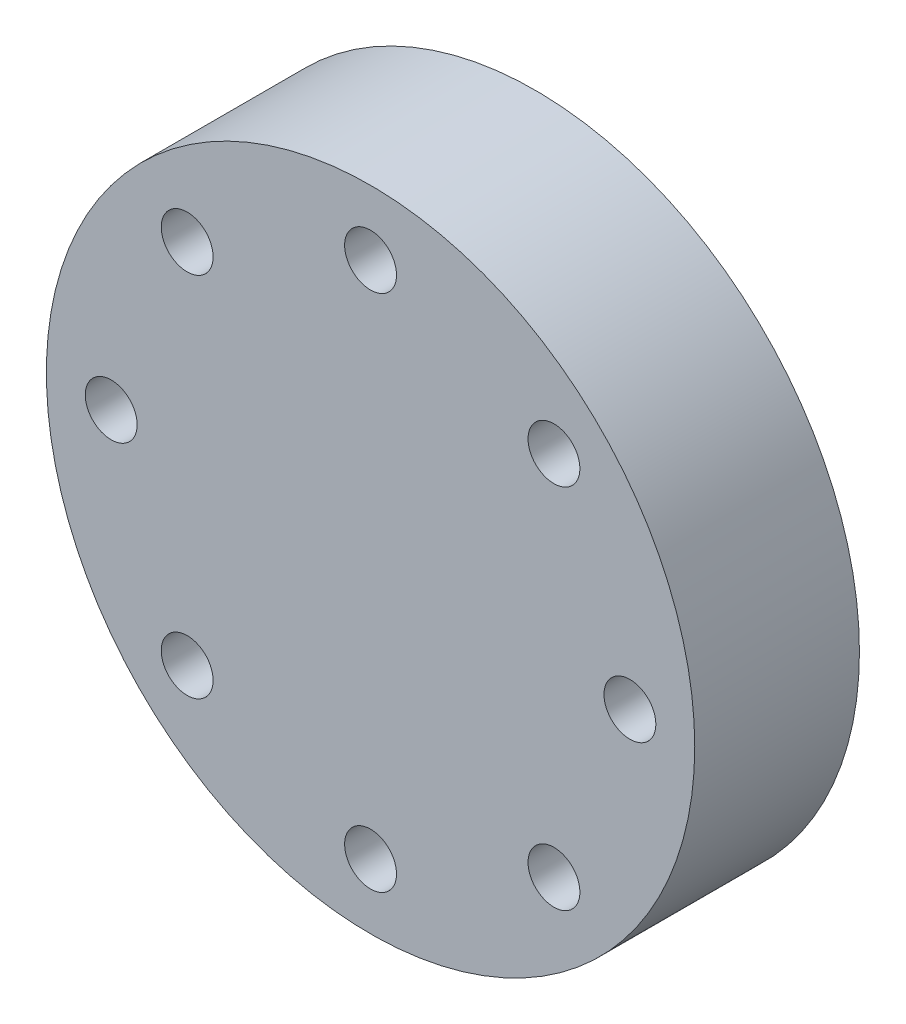
ISO-10303-21;
HEADER;
FILE_DESCRIPTION(('STEP AP214'),'2;1');
FILE_NAME('part.step','',(''),(''),'','','');
FILE_SCHEMA(('AUTOMOTIVE_DESIGN { 1 0 10303 214 1 1 1 1 }'));
ENDSEC;
DATA;
#1=APPLICATION_CONTEXT('core data for automotive mechanical design processes');
#2=APPLICATION_PROTOCOL_DEFINITION('international standard','automotive_design',2000,#1);
#3=PRODUCT_CONTEXT('',#1,'mechanical');
#4=PRODUCT('Part','Part','',(#3));
#5=PRODUCT_RELATED_PRODUCT_CATEGORY('part','',(#4));
#6=PRODUCT_DEFINITION_FORMATION('','',#4);
#7=PRODUCT_DEFINITION_CONTEXT('part definition',#1,'design');
#8=PRODUCT_DEFINITION('design','',#6,#7);
#9=PRODUCT_DEFINITION_SHAPE('','',#8);
#10=(LENGTH_UNIT() NAMED_UNIT(*) SI_UNIT(.MILLI.,.METRE.));
#11=(NAMED_UNIT(*) PLANE_ANGLE_UNIT() SI_UNIT($,.RADIAN.));
#12=(NAMED_UNIT(*) SI_UNIT($,.STERADIAN.) SOLID_ANGLE_UNIT());
#13=UNCERTAINTY_MEASURE_WITH_UNIT(LENGTH_MEASURE(1.E-05),#10,'distance_accuracy_value','');
#14=(GEOMETRIC_REPRESENTATION_CONTEXT(3) GLOBAL_UNCERTAINTY_ASSIGNED_CONTEXT((#13)) GLOBAL_UNIT_ASSIGNED_CONTEXT((#10,
#11,#12)) REPRESENTATION_CONTEXT('',''));
#15=CARTESIAN_POINT('',(0.,0.,0.));
#16=DIRECTION('',(0.,0.,1.));
#17=DIRECTION('',(1.,0.,0.));
#18=AXIS2_PLACEMENT_3D('',#15,#16,#17);
#19=CARTESIAN_POINT('',(0.,0.,25.4));
#20=DIRECTION('',(0.,0.,1.));
#21=DIRECTION('',(1.,0.,0.));
#22=AXIS2_PLACEMENT_3D('',#19,#20,#21);
#23=PLANE('',#22);
#24=CARTESIAN_POINT('',(-39.9999999999983,-1.70897650622168E-12,25.4));
#25=DIRECTION('',(0.,0.,1.));
#26=DIRECTION('',(1.,0.,0.));
#27=AXIS2_PLACEMENT_3D('',#24,#25,#26);
#28=CIRCLE('',#27,4.);
#29=CARTESIAN_POINT('',(-35.9999999999983,-1.70897650622168E-12,25.4));
#30=VERTEX_POINT('',#29);
#31=EDGE_CURVE('E77',#30,#30,#28,.T.);
#32=ORIENTED_EDGE('',*,*,#31,.F.);
#33=EDGE_LOOP('',(#32));
#34=FACE_BOUND('',#33,.T.);
#35=CARTESIAN_POINT('',(3.40815583805019E-12,-40.,25.4));
#36=DIRECTION('',(0.,0.,1.));
#37=DIRECTION('',(1.,0.,0.));
#38=AXIS2_PLACEMENT_3D('',#35,#36,#37);
#39=CIRCLE('',#38,4.);
#40=CARTESIAN_POINT('',(4.00000000000341,-40.,25.4));
#41=VERTEX_POINT('',#40);
#42=EDGE_CURVE('E65',#41,#41,#39,.T.);
#43=ORIENTED_EDGE('',*,*,#42,.F.);
#44=EDGE_LOOP('',(#43));
#45=FACE_BOUND('',#44,.T.);
#46=CARTESIAN_POINT('',(40.0000000000017,1.70407791902509E-12,25.4));
#47=DIRECTION('',(0.,0.,1.));
#48=DIRECTION('',(1.,0.,0.));
#49=AXIS2_PLACEMENT_3D('',#46,#47,#48);
#50=CIRCLE('',#49,4.);
#51=CARTESIAN_POINT('',(44.0000000000017,1.70407791902509E-12,25.4));
#52=VERTEX_POINT('',#51);
#53=EDGE_CURVE('E53',#52,#52,#50,.T.);
#54=ORIENTED_EDGE('',*,*,#53,.F.);
#55=EDGE_LOOP('',(#54));
#56=FACE_BOUND('',#55,.T.);
#57=CARTESIAN_POINT('',(0.,40.,25.4));
#58=DIRECTION('',(0.,0.,1.));
#59=DIRECTION('',(1.,0.,0.));
#60=AXIS2_PLACEMENT_3D('',#57,#58,#59);
#61=CIRCLE('',#60,4.);
#62=CARTESIAN_POINT('',(4.,40.,25.4));
#63=VERTEX_POINT('',#62);
#64=EDGE_CURVE('E42',#63,#63,#61,.T.);
#65=ORIENTED_EDGE('',*,*,#64,.F.);
#66=EDGE_LOOP('',(#65));
#67=FACE_BOUND('',#66,.T.);
#68=CARTESIAN_POINT('',(0.,0.,25.4));
#69=DIRECTION('',(0.,0.,1.));
#70=DIRECTION('',(1.,0.,0.));
#71=AXIS2_PLACEMENT_3D('',#68,#69,#70);
#72=CIRCLE('',#71,50.);
#73=CARTESIAN_POINT('',(50.,0.,25.4));
#74=VERTEX_POINT('',#73);
#75=EDGE_CURVE('E10',#74,#74,#72,.T.);
#76=ORIENTED_EDGE('',*,*,#75,.T.);
#77=EDGE_LOOP('',(#76));
#78=FACE_BOUND('',#77,.T.);
#79=CARTESIAN_POINT('',(28.2842712474624,28.2842712474631,25.4));
#80=DIRECTION('',(0.,0.,1.));
#81=DIRECTION('',(1.,0.,0.));
#82=AXIS2_PLACEMENT_3D('',#79,#80,#81);
#83=CIRCLE('',#82,4.);
#84=CARTESIAN_POINT('',(32.2842712474624,28.2842712474631,25.4));
#85=VERTEX_POINT('',#84);
#86=EDGE_CURVE('E47',#85,#85,#83,.T.);
#87=ORIENTED_EDGE('',*,*,#86,.F.);
#88=EDGE_LOOP('',(#87));
#89=FACE_BOUND('',#88,.T.);
#90=CARTESIAN_POINT('',(28.2842712474648,-28.2842712474607,25.4));
#91=DIRECTION('',(0.,0.,1.));
#92=DIRECTION('',(1.,0.,0.));
#93=AXIS2_PLACEMENT_3D('',#90,#91,#92);
#94=CIRCLE('',#93,4.);
#95=CARTESIAN_POINT('',(32.2842712474648,-28.2842712474607,25.4));
#96=VERTEX_POINT('',#95);
#97=EDGE_CURVE('E59',#96,#96,#94,.T.);
#98=ORIENTED_EDGE('',*,*,#97,.F.);
#99=EDGE_LOOP('',(#98));
#100=FACE_BOUND('',#99,.T.);
#101=CARTESIAN_POINT('',(-28.284271247459,-28.2842712474631,25.4));
#102=DIRECTION('',(0.,0.,1.));
#103=DIRECTION('',(1.,0.,0.));
#104=AXIS2_PLACEMENT_3D('',#101,#102,#103);
#105=CIRCLE('',#104,4.);
#106=CARTESIAN_POINT('',(-24.284271247459,-28.2842712474631,25.4));
#107=VERTEX_POINT('',#106);
#108=EDGE_CURVE('E71',#107,#107,#105,.T.);
#109=ORIENTED_EDGE('',*,*,#108,.F.);
#110=EDGE_LOOP('',(#109));
#111=FACE_BOUND('',#110,.T.);
#112=CARTESIAN_POINT('',(-28.2842712474614,28.2842712474607,25.4));
#113=DIRECTION('',(0.,0.,1.));
#114=DIRECTION('',(1.,0.,0.));
#115=AXIS2_PLACEMENT_3D('',#112,#113,#114);
#116=CIRCLE('',#115,4.);
#117=CARTESIAN_POINT('',(-24.2842712474614,28.2842712474607,25.4));
#118=VERTEX_POINT('',#117);
#119=EDGE_CURVE('E83',#118,#118,#116,.T.);
#120=ORIENTED_EDGE('',*,*,#119,.F.);
#121=EDGE_LOOP('',(#120));
#122=FACE_BOUND('',#121,.T.);
#123=ADVANCED_FACE('F31',(#34,#45,#56,#67,#78,#89,#100,#111,#122),#23,.T.);
#124=CARTESIAN_POINT('',(0.,0.,0.));
#125=DIRECTION('',(0.,0.,1.));
#126=DIRECTION('',(1.,0.,0.));
#127=AXIS2_PLACEMENT_3D('',#124,#125,#126);
#128=PLANE('',#127);
#129=CARTESIAN_POINT('',(0.,0.,0.));
#130=DIRECTION('',(0.,0.,1.));
#131=DIRECTION('',(1.,0.,0.));
#132=AXIS2_PLACEMENT_3D('',#129,#130,#131);
#133=CIRCLE('',#132,50.);
#134=CARTESIAN_POINT('',(50.,0.,0.));
#135=VERTEX_POINT('',#134);
#136=EDGE_CURVE('E35',#135,#135,#133,.T.);
#137=ORIENTED_EDGE('',*,*,#136,.F.);
#138=EDGE_LOOP('',(#137));
#139=FACE_BOUND('',#138,.T.);
#140=CARTESIAN_POINT('',(0.,40.,0.));
#141=DIRECTION('',(0.,0.,1.));
#142=DIRECTION('',(1.,0.,0.));
#143=AXIS2_PLACEMENT_3D('',#140,#141,#142);
#144=CIRCLE('',#143,4.);
#145=CARTESIAN_POINT('',(4.,40.,0.));
#146=VERTEX_POINT('',#145);
#147=EDGE_CURVE('E44',#146,#146,#144,.T.);
#148=ORIENTED_EDGE('',*,*,#147,.T.);
#149=EDGE_LOOP('',(#148));
#150=FACE_BOUND('',#149,.T.);
#151=CARTESIAN_POINT('',(28.2842712474624,28.2842712474631,0.));
#152=DIRECTION('',(0.,0.,1.));
#153=DIRECTION('',(1.,0.,0.));
#154=AXIS2_PLACEMENT_3D('',#151,#152,#153);
#155=CIRCLE('',#154,4.);
#156=CARTESIAN_POINT('',(32.2842712474624,28.2842712474631,0.));
#157=VERTEX_POINT('',#156);
#158=EDGE_CURVE('E50',#157,#157,#155,.T.);
#159=ORIENTED_EDGE('',*,*,#158,.T.);
#160=EDGE_LOOP('',(#159));
#161=FACE_BOUND('',#160,.T.);
#162=CARTESIAN_POINT('',(40.0000000000017,1.70407791902509E-12,0.));
#163=DIRECTION('',(0.,0.,1.));
#164=DIRECTION('',(1.,0.,0.));
#165=AXIS2_PLACEMENT_3D('',#162,#163,#164);
#166=CIRCLE('',#165,4.);
#167=CARTESIAN_POINT('',(44.0000000000017,1.70407791902509E-12,0.));
#168=VERTEX_POINT('',#167);
#169=EDGE_CURVE('E56',#168,#168,#166,.T.);
#170=ORIENTED_EDGE('',*,*,#169,.T.);
#171=EDGE_LOOP('',(#170));
#172=FACE_BOUND('',#171,.T.);
#173=CARTESIAN_POINT('',(28.2842712474648,-28.2842712474607,0.));
#174=DIRECTION('',(0.,0.,1.));
#175=DIRECTION('',(1.,0.,0.));
#176=AXIS2_PLACEMENT_3D('',#173,#174,#175);
#177=CIRCLE('',#176,4.);
#178=CARTESIAN_POINT('',(32.2842712474648,-28.2842712474607,0.));
#179=VERTEX_POINT('',#178);
#180=EDGE_CURVE('E62',#179,#179,#177,.T.);
#181=ORIENTED_EDGE('',*,*,#180,.T.);
#182=EDGE_LOOP('',(#181));
#183=FACE_BOUND('',#182,.T.);
#184=CARTESIAN_POINT('',(3.40815583805019E-12,-40.,0.));
#185=DIRECTION('',(0.,0.,1.));
#186=DIRECTION('',(1.,0.,0.));
#187=AXIS2_PLACEMENT_3D('',#184,#185,#186);
#188=CIRCLE('',#187,4.);
#189=CARTESIAN_POINT('',(4.00000000000341,-40.,0.));
#190=VERTEX_POINT('',#189);
#191=EDGE_CURVE('E68',#190,#190,#188,.T.);
#192=ORIENTED_EDGE('',*,*,#191,.T.);
#193=EDGE_LOOP('',(#192));
#194=FACE_BOUND('',#193,.T.);
#195=CARTESIAN_POINT('',(-28.284271247459,-28.2842712474631,0.));
#196=DIRECTION('',(0.,0.,1.));
#197=DIRECTION('',(1.,0.,0.));
#198=AXIS2_PLACEMENT_3D('',#195,#196,#197);
#199=CIRCLE('',#198,4.);
#200=CARTESIAN_POINT('',(-24.284271247459,-28.2842712474631,0.));
#201=VERTEX_POINT('',#200);
#202=EDGE_CURVE('E74',#201,#201,#199,.T.);
#203=ORIENTED_EDGE('',*,*,#202,.T.);
#204=EDGE_LOOP('',(#203));
#205=FACE_BOUND('',#204,.T.);
#206=CARTESIAN_POINT('',(-39.9999999999983,-1.70897650622168E-12,0.));
#207=DIRECTION('',(0.,0.,1.));
#208=DIRECTION('',(1.,0.,0.));
#209=AXIS2_PLACEMENT_3D('',#206,#207,#208);
#210=CIRCLE('',#209,4.);
#211=CARTESIAN_POINT('',(-35.9999999999983,-1.70897650622168E-12,0.));
#212=VERTEX_POINT('',#211);
#213=EDGE_CURVE('E80',#212,#212,#210,.T.);
#214=ORIENTED_EDGE('',*,*,#213,.T.);
#215=EDGE_LOOP('',(#214));
#216=FACE_BOUND('',#215,.T.);
#217=CARTESIAN_POINT('',(-28.2842712474614,28.2842712474607,0.));
#218=DIRECTION('',(0.,0.,1.));
#219=DIRECTION('',(1.,0.,0.));
#220=AXIS2_PLACEMENT_3D('',#217,#218,#219);
#221=CIRCLE('',#220,4.);
#222=CARTESIAN_POINT('',(-24.2842712474614,28.2842712474607,0.));
#223=VERTEX_POINT('',#222);
#224=EDGE_CURVE('E86',#223,#223,#221,.T.);
#225=ORIENTED_EDGE('',*,*,#224,.T.);
#226=EDGE_LOOP('',(#225));
#227=FACE_BOUND('',#226,.T.);
#228=ADVANCED_FACE('F96',(#139,#150,#161,#172,#183,#194,#205,#216,#227),#128,.F.);
#229=CARTESIAN_POINT('',(0.,0.,25.4));
#230=DIRECTION('',(0.,0.,-1.));
#231=DIRECTION('',(-1.,0.,0.));
#232=AXIS2_PLACEMENT_3D('',#229,#230,#231);
#233=CYLINDRICAL_SURFACE('',#232,50.);
#234=ORIENTED_EDGE('',*,*,#75,.F.);
#235=EDGE_LOOP('',(#234));
#236=FACE_BOUND('',#235,.T.);
#237=ORIENTED_EDGE('',*,*,#136,.T.);
#238=EDGE_LOOP('',(#237));
#239=FACE_BOUND('',#238,.T.);
#240=ADVANCED_FACE('F33',(#236,#239),#233,.T.);
#241=CARTESIAN_POINT('',(0.,40.,25.4));
#242=DIRECTION('',(0.,0.,-1.));
#243=DIRECTION('',(-1.,0.,0.));
#244=AXIS2_PLACEMENT_3D('',#241,#242,#243);
#245=CYLINDRICAL_SURFACE('',#244,4.);
#246=ORIENTED_EDGE('',*,*,#64,.T.);
#247=EDGE_LOOP('',(#246));
#248=FACE_BOUND('',#247,.T.);
#249=ORIENTED_EDGE('',*,*,#147,.F.);
#250=EDGE_LOOP('',(#249));
#251=FACE_BOUND('',#250,.T.);
#252=ADVANCED_FACE('F106',(#248,#251),#245,.F.);
#253=CARTESIAN_POINT('',(28.2842712474624,28.2842712474631,25.4));
#254=DIRECTION('',(0.,0.,-1.));
#255=DIRECTION('',(-1.,0.,0.));
#256=AXIS2_PLACEMENT_3D('',#253,#254,#255);
#257=CYLINDRICAL_SURFACE('',#256,4.);
#258=ORIENTED_EDGE('',*,*,#86,.T.);
#259=EDGE_LOOP('',(#258));
#260=FACE_BOUND('',#259,.T.);
#261=ORIENTED_EDGE('',*,*,#158,.F.);
#262=EDGE_LOOP('',(#261));
#263=FACE_BOUND('',#262,.T.);
#264=ADVANCED_FACE('F109',(#260,#263),#257,.F.);
#265=CARTESIAN_POINT('',(40.0000000000017,1.70407791902509E-12,25.4));
#266=DIRECTION('',(0.,0.,-1.));
#267=DIRECTION('',(-1.,0.,0.));
#268=AXIS2_PLACEMENT_3D('',#265,#266,#267);
#269=CYLINDRICAL_SURFACE('',#268,4.);
#270=ORIENTED_EDGE('',*,*,#53,.T.);
#271=EDGE_LOOP('',(#270));
#272=FACE_BOUND('',#271,.T.);
#273=ORIENTED_EDGE('',*,*,#169,.F.);
#274=EDGE_LOOP('',(#273));
#275=FACE_BOUND('',#274,.T.);
#276=ADVANCED_FACE('F113',(#272,#275),#269,.F.);
#277=CARTESIAN_POINT('',(28.2842712474648,-28.2842712474607,25.4));
#278=DIRECTION('',(0.,0.,-1.));
#279=DIRECTION('',(-1.,0.,0.));
#280=AXIS2_PLACEMENT_3D('',#277,#278,#279);
#281=CYLINDRICAL_SURFACE('',#280,4.);
#282=ORIENTED_EDGE('',*,*,#97,.T.);
#283=EDGE_LOOP('',(#282));
#284=FACE_BOUND('',#283,.T.);
#285=ORIENTED_EDGE('',*,*,#180,.F.);
#286=EDGE_LOOP('',(#285));
#287=FACE_BOUND('',#286,.T.);
#288=ADVANCED_FACE('F117',(#284,#287),#281,.F.);
#289=CARTESIAN_POINT('',(3.40815583805019E-12,-40.,25.4));
#290=DIRECTION('',(0.,0.,-1.));
#291=DIRECTION('',(-1.,0.,0.));
#292=AXIS2_PLACEMENT_3D('',#289,#290,#291);
#293=CYLINDRICAL_SURFACE('',#292,4.);
#294=ORIENTED_EDGE('',*,*,#42,.T.);
#295=EDGE_LOOP('',(#294));
#296=FACE_BOUND('',#295,.T.);
#297=ORIENTED_EDGE('',*,*,#191,.F.);
#298=EDGE_LOOP('',(#297));
#299=FACE_BOUND('',#298,.T.);
#300=ADVANCED_FACE('F121',(#296,#299),#293,.F.);
#301=CARTESIAN_POINT('',(-28.284271247459,-28.2842712474631,25.4));
#302=DIRECTION('',(0.,0.,-1.));
#303=DIRECTION('',(-1.,0.,0.));
#304=AXIS2_PLACEMENT_3D('',#301,#302,#303);
#305=CYLINDRICAL_SURFACE('',#304,4.);
#306=ORIENTED_EDGE('',*,*,#108,.T.);
#307=EDGE_LOOP('',(#306));
#308=FACE_BOUND('',#307,.T.);
#309=ORIENTED_EDGE('',*,*,#202,.F.);
#310=EDGE_LOOP('',(#309));
#311=FACE_BOUND('',#310,.T.);
#312=ADVANCED_FACE('F125',(#308,#311),#305,.F.);
#313=CARTESIAN_POINT('',(-39.9999999999983,-1.70897650622168E-12,25.4));
#314=DIRECTION('',(0.,0.,-1.));
#315=DIRECTION('',(-1.,0.,0.));
#316=AXIS2_PLACEMENT_3D('',#313,#314,#315);
#317=CYLINDRICAL_SURFACE('',#316,4.);
#318=ORIENTED_EDGE('',*,*,#31,.T.);
#319=EDGE_LOOP('',(#318));
#320=FACE_BOUND('',#319,.T.);
#321=ORIENTED_EDGE('',*,*,#213,.F.);
#322=EDGE_LOOP('',(#321));
#323=FACE_BOUND('',#322,.T.);
#324=ADVANCED_FACE('F129',(#320,#323),#317,.F.);
#325=CARTESIAN_POINT('',(-28.2842712474614,28.2842712474607,25.4));
#326=DIRECTION('',(0.,0.,-1.));
#327=DIRECTION('',(-1.,0.,0.));
#328=AXIS2_PLACEMENT_3D('',#325,#326,#327);
#329=CYLINDRICAL_SURFACE('',#328,4.);
#330=ORIENTED_EDGE('',*,*,#119,.T.);
#331=EDGE_LOOP('',(#330));
#332=FACE_BOUND('',#331,.T.);
#333=ORIENTED_EDGE('',*,*,#224,.F.);
#334=EDGE_LOOP('',(#333));
#335=FACE_BOUND('',#334,.T.);
#336=ADVANCED_FACE('F92',(#332,#335),#329,.F.);
#337=CLOSED_SHELL('',(#123,#228,#240,#252,#264,#276,#288,#300,#312,#324,#336));
#338=MANIFOLD_SOLID_BREP('B2',#337);
#339=ADVANCED_BREP_SHAPE_REPRESENTATION('',(#18,#338),#14);
#340=SHAPE_DEFINITION_REPRESENTATION(#9,#339);
ENDSEC;
END-ISO-10303-21;
